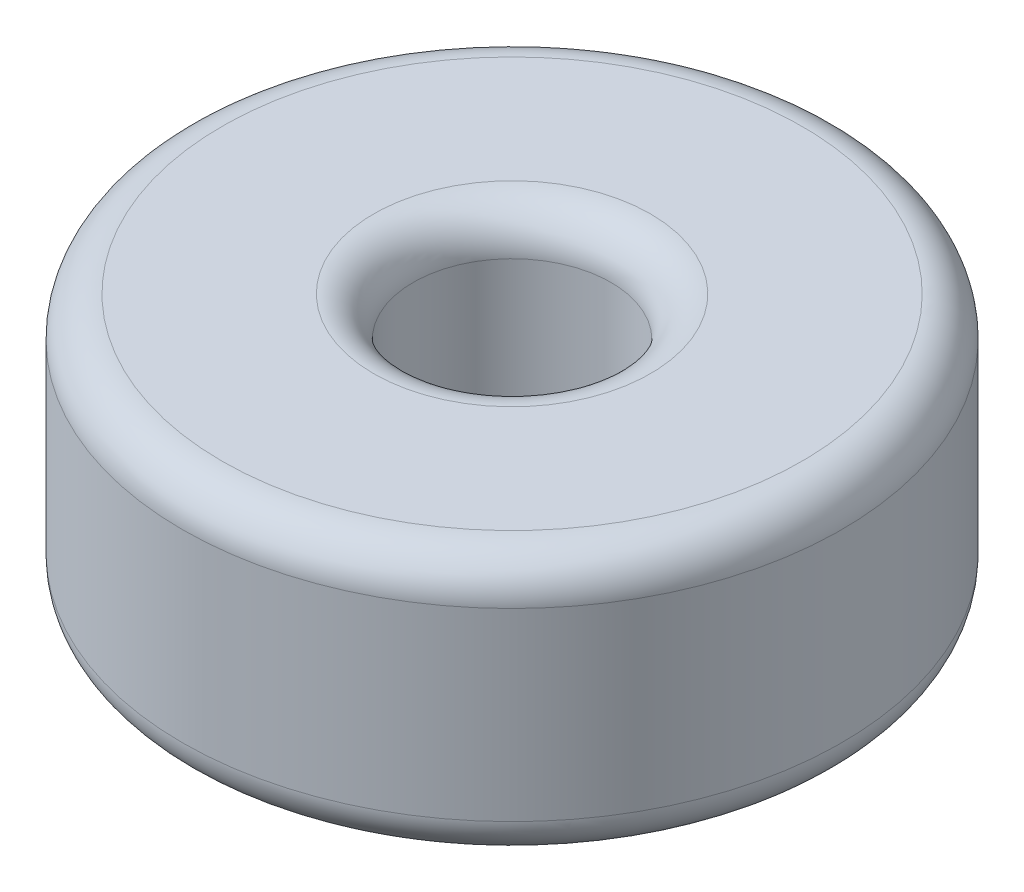
ISO-10303-21;
HEADER;
FILE_DESCRIPTION(('STEP AP214'),'2;1');
FILE_NAME('part.step','',(''),(''),'','','');
FILE_SCHEMA(('AUTOMOTIVE_DESIGN { 1 0 10303 214 1 1 1 1 }'));
ENDSEC;
DATA;
#1=APPLICATION_CONTEXT('core data for automotive mechanical design processes');
#2=APPLICATION_PROTOCOL_DEFINITION('international standard','automotive_design',2000,#1);
#3=PRODUCT_CONTEXT('',#1,'mechanical');
#4=PRODUCT('Part','Part','',(#3));
#5=PRODUCT_RELATED_PRODUCT_CATEGORY('part','',(#4));
#6=PRODUCT_DEFINITION_FORMATION('','',#4);
#7=PRODUCT_DEFINITION_CONTEXT('part definition',#1,'design');
#8=PRODUCT_DEFINITION('design','',#6,#7);
#9=PRODUCT_DEFINITION_SHAPE('','',#8);
#10=(LENGTH_UNIT() NAMED_UNIT(*) SI_UNIT(.MILLI.,.METRE.));
#11=(NAMED_UNIT(*) PLANE_ANGLE_UNIT() SI_UNIT($,.RADIAN.));
#12=(NAMED_UNIT(*) SI_UNIT($,.STERADIAN.) SOLID_ANGLE_UNIT());
#13=UNCERTAINTY_MEASURE_WITH_UNIT(LENGTH_MEASURE(1.E-05),#10,'distance_accuracy_value','');
#14=(GEOMETRIC_REPRESENTATION_CONTEXT(3) GLOBAL_UNCERTAINTY_ASSIGNED_CONTEXT((#13)) GLOBAL_UNIT_ASSIGNED_CONTEXT((#10,
#11,#12)) REPRESENTATION_CONTEXT('',''));
#15=CARTESIAN_POINT('',(0.,0.,0.));
#16=DIRECTION('',(0.,0.,1.));
#17=DIRECTION('',(1.,0.,0.));
#18=AXIS2_PLACEMENT_3D('',#15,#16,#17);
#19=CARTESIAN_POINT('',(0.,4.,0.));
#20=DIRECTION('',(0.,1.,0.));
#21=DIRECTION('',(0.,0.,1.));
#22=AXIS2_PLACEMENT_3D('',#19,#20,#21);
#23=PLANE('',#22);
#24=CARTESIAN_POINT('',(0.,4.,0.));
#25=DIRECTION('',(0.,1.,0.));
#26=DIRECTION('',(0.,0.,1.));
#27=AXIS2_PLACEMENT_3D('',#24,#25,#26);
#28=CIRCLE('',#27,2.1);
#29=CARTESIAN_POINT('',(0.,4.,2.1));
#30=VERTEX_POINT('',#29);
#31=EDGE_CURVE('E10',#30,#30,#28,.F.);
#32=ORIENTED_EDGE('',*,*,#31,.T.);
#33=EDGE_LOOP('',(#32));
#34=FACE_BOUND('',#33,.T.);
#35=CARTESIAN_POINT('',(0.,4.,0.));
#36=DIRECTION('',(0.,1.,0.));
#37=DIRECTION('',(0.,0.,1.));
#38=AXIS2_PLACEMENT_3D('',#35,#36,#37);
#39=CIRCLE('',#38,4.4);
#40=CARTESIAN_POINT('',(0.,4.,4.4));
#41=VERTEX_POINT('',#40);
#42=EDGE_CURVE('E38',#41,#41,#39,.T.);
#43=ORIENTED_EDGE('',*,*,#42,.T.);
#44=EDGE_LOOP('',(#43));
#45=FACE_BOUND('',#44,.T.);
#46=ADVANCED_FACE('F31',(#34,#45),#23,.T.);
#47=CARTESIAN_POINT('',(0.,0.,0.));
#48=DIRECTION('',(0.,1.,0.));
#49=DIRECTION('',(0.,0.,1.));
#50=AXIS2_PLACEMENT_3D('',#47,#48,#49);
#51=PLANE('',#50);
#52=CARTESIAN_POINT('',(0.,0.,0.));
#53=DIRECTION('',(0.,1.,0.));
#54=DIRECTION('',(0.,0.,1.));
#55=AXIS2_PLACEMENT_3D('',#52,#53,#54);
#56=CIRCLE('',#55,2.1);
#57=CARTESIAN_POINT('',(0.,0.,2.1));
#58=VERTEX_POINT('',#57);
#59=EDGE_CURVE('E57',#58,#58,#56,.T.);
#60=ORIENTED_EDGE('',*,*,#59,.T.);
#61=EDGE_LOOP('',(#60));
#62=FACE_BOUND('',#61,.T.);
#63=CARTESIAN_POINT('',(0.,0.,0.));
#64=DIRECTION('',(0.,1.,0.));
#65=DIRECTION('',(0.,0.,1.));
#66=AXIS2_PLACEMENT_3D('',#63,#64,#65);
#67=CIRCLE('',#66,4.4);
#68=CARTESIAN_POINT('',(0.,0.,4.4));
#69=VERTEX_POINT('',#68);
#70=EDGE_CURVE('E60',#69,#69,#67,.F.);
#71=ORIENTED_EDGE('',*,*,#70,.T.);
#72=EDGE_LOOP('',(#71));
#73=FACE_BOUND('',#72,.T.);
#74=ADVANCED_FACE('F64',(#62,#73),#51,.F.);
#75=CARTESIAN_POINT('',(0.,4.,0.));
#76=DIRECTION('',(0.,-1.,0.));
#77=DIRECTION('',(0.,0.,-1.));
#78=AXIS2_PLACEMENT_3D('',#75,#76,#77);
#79=CYLINDRICAL_SURFACE('',#78,5.);
#80=CARTESIAN_POINT('',(0.,0.6,0.));
#81=DIRECTION('',(0.,1.,0.));
#82=DIRECTION('',(0.,0.,1.));
#83=AXIS2_PLACEMENT_3D('',#80,#81,#82);
#84=CIRCLE('',#83,5.);
#85=CARTESIAN_POINT('',(0.,0.6,5.));
#86=VERTEX_POINT('',#85);
#87=EDGE_CURVE('E42',#86,#86,#84,.T.);
#88=ORIENTED_EDGE('',*,*,#87,.T.);
#89=EDGE_LOOP('',(#88));
#90=FACE_BOUND('',#89,.T.);
#91=CARTESIAN_POINT('',(0.,3.4,0.));
#92=DIRECTION('',(0.,1.,0.));
#93=DIRECTION('',(0.,0.,1.));
#94=AXIS2_PLACEMENT_3D('',#91,#92,#93);
#95=CIRCLE('',#94,5.);
#96=CARTESIAN_POINT('',(0.,3.4,5.));
#97=VERTEX_POINT('',#96);
#98=EDGE_CURVE('E46',#97,#97,#95,.F.);
#99=ORIENTED_EDGE('',*,*,#98,.T.);
#100=EDGE_LOOP('',(#99));
#101=FACE_BOUND('',#100,.T.);
#102=ADVANCED_FACE('F74',(#90,#101),#79,.T.);
#103=CARTESIAN_POINT('',(0.,4.,0.));
#104=DIRECTION('',(0.,-1.,0.));
#105=DIRECTION('',(0.,0.,-1.));
#106=AXIS2_PLACEMENT_3D('',#103,#104,#105);
#107=CYLINDRICAL_SURFACE('',#106,1.5);
#108=CARTESIAN_POINT('',(0.,0.6,0.));
#109=DIRECTION('',(0.,1.,0.));
#110=DIRECTION('',(0.,0.,1.));
#111=AXIS2_PLACEMENT_3D('',#108,#109,#110);
#112=CIRCLE('',#111,1.5);
#113=CARTESIAN_POINT('',(0.,0.6,1.5));
#114=VERTEX_POINT('',#113);
#115=EDGE_CURVE('E51',#114,#114,#112,.F.);
#116=ORIENTED_EDGE('',*,*,#115,.T.);
#117=EDGE_LOOP('',(#116));
#118=FACE_BOUND('',#117,.T.);
#119=CARTESIAN_POINT('',(0.,3.4,0.));
#120=DIRECTION('',(0.,1.,0.));
#121=DIRECTION('',(0.,0.,1.));
#122=AXIS2_PLACEMENT_3D('',#119,#120,#121);
#123=CIRCLE('',#122,1.5);
#124=CARTESIAN_POINT('',(0.,3.4,1.5));
#125=VERTEX_POINT('',#124);
#126=EDGE_CURVE('E54',#125,#125,#123,.T.);
#127=ORIENTED_EDGE('',*,*,#126,.T.);
#128=EDGE_LOOP('',(#127));
#129=FACE_BOUND('',#128,.T.);
#130=ADVANCED_FACE('F77',(#118,#129),#107,.F.);
#131=CARTESIAN_POINT('',(0.,0.6,0.));
#132=DIRECTION('',(0.,1.,0.));
#133=DIRECTION('',(0.,0.,1.));
#134=AXIS2_PLACEMENT_3D('',#131,#132,#133);
#135=TOROIDAL_SURFACE('',#134,2.1,0.6);
#136=ORIENTED_EDGE('',*,*,#115,.F.);
#137=EDGE_LOOP('',(#136));
#138=FACE_BOUND('',#137,.T.);
#139=ORIENTED_EDGE('',*,*,#59,.F.);
#140=EDGE_LOOP('',(#139));
#141=FACE_BOUND('',#140,.T.);
#142=ADVANCED_FACE('F70',(#138,#141),#135,.T.);
#143=CARTESIAN_POINT('',(0.,0.6,0.));
#144=DIRECTION('',(0.,1.,0.));
#145=DIRECTION('',(0.,0.,1.));
#146=AXIS2_PLACEMENT_3D('',#143,#144,#145);
#147=TOROIDAL_SURFACE('',#146,4.4,0.6);
#148=ORIENTED_EDGE('',*,*,#70,.F.);
#149=EDGE_LOOP('',(#148));
#150=FACE_BOUND('',#149,.T.);
#151=ORIENTED_EDGE('',*,*,#87,.F.);
#152=EDGE_LOOP('',(#151));
#153=FACE_BOUND('',#152,.T.);
#154=ADVANCED_FACE('F66',(#150,#153),#147,.T.);
#155=CARTESIAN_POINT('',(0.,3.4,0.));
#156=DIRECTION('',(0.,1.,0.));
#157=DIRECTION('',(0.,0.,1.));
#158=AXIS2_PLACEMENT_3D('',#155,#156,#157);
#159=TOROIDAL_SURFACE('',#158,2.1,0.6);
#160=ORIENTED_EDGE('',*,*,#31,.F.);
#161=EDGE_LOOP('',(#160));
#162=FACE_BOUND('',#161,.T.);
#163=ORIENTED_EDGE('',*,*,#126,.F.);
#164=EDGE_LOOP('',(#163));
#165=FACE_BOUND('',#164,.T.);
#166=ADVANCED_FACE('F69',(#162,#165),#159,.T.);
#167=CARTESIAN_POINT('',(0.,3.4,0.));
#168=DIRECTION('',(0.,1.,0.));
#169=DIRECTION('',(0.,0.,1.));
#170=AXIS2_PLACEMENT_3D('',#167,#168,#169);
#171=TOROIDAL_SURFACE('',#170,4.4,0.6);
#172=ORIENTED_EDGE('',*,*,#98,.F.);
#173=EDGE_LOOP('',(#172));
#174=FACE_BOUND('',#173,.T.);
#175=ORIENTED_EDGE('',*,*,#42,.F.);
#176=EDGE_LOOP('',(#175));
#177=FACE_BOUND('',#176,.T.);
#178=ADVANCED_FACE('F33',(#174,#177),#171,.T.);
#179=CLOSED_SHELL('',(#46,#74,#102,#130,#142,#154,#166,#178));
#180=MANIFOLD_SOLID_BREP('B2',#179);
#181=ADVANCED_BREP_SHAPE_REPRESENTATION('',(#18,#180),#14);
#182=SHAPE_DEFINITION_REPRESENTATION(#9,#181);
ENDSEC;
END-ISO-10303-21;
